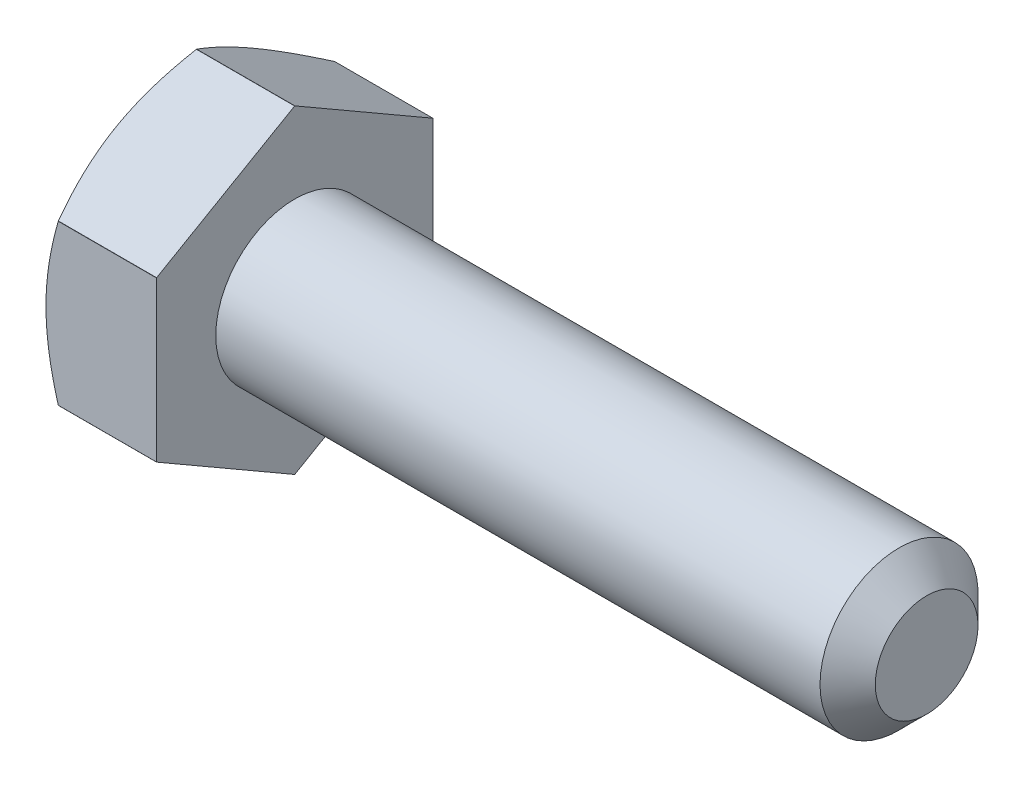
ISO-10303-21;
HEADER;
FILE_DESCRIPTION(('STEP AP214'),'2;1');
FILE_NAME('part.step','',(''),(''),'','','');
FILE_SCHEMA(('AUTOMOTIVE_DESIGN { 1 0 10303 214 1 1 1 1 }'));
ENDSEC;
DATA;
#1=APPLICATION_CONTEXT('core data for automotive mechanical design processes');
#2=APPLICATION_PROTOCOL_DEFINITION('international standard','automotive_design',2000,#1);
#3=PRODUCT_CONTEXT('',#1,'mechanical');
#4=PRODUCT('Part','Part','',(#3));
#5=PRODUCT_RELATED_PRODUCT_CATEGORY('part','',(#4));
#6=PRODUCT_DEFINITION_FORMATION('','',#4);
#7=PRODUCT_DEFINITION_CONTEXT('part definition',#1,'design');
#8=PRODUCT_DEFINITION('design','',#6,#7);
#9=PRODUCT_DEFINITION_SHAPE('','',#8);
#10=(LENGTH_UNIT() NAMED_UNIT(*) SI_UNIT(.MILLI.,.METRE.));
#11=(NAMED_UNIT(*) PLANE_ANGLE_UNIT() SI_UNIT($,.RADIAN.));
#12=(NAMED_UNIT(*) SI_UNIT($,.STERADIAN.) SOLID_ANGLE_UNIT());
#13=UNCERTAINTY_MEASURE_WITH_UNIT(LENGTH_MEASURE(1.E-05),#10,'distance_accuracy_value','');
#14=(GEOMETRIC_REPRESENTATION_CONTEXT(3) GLOBAL_UNCERTAINTY_ASSIGNED_CONTEXT((#13)) GLOBAL_UNIT_ASSIGNED_CONTEXT((#10,
#11,#12)) REPRESENTATION_CONTEXT('',''));
#15=CARTESIAN_POINT('',(0.,0.,0.));
#16=DIRECTION('',(0.,0.,1.));
#17=DIRECTION('',(1.,0.,0.));
#18=AXIS2_PLACEMENT_3D('',#15,#16,#17);
#19=CARTESIAN_POINT('',(-21.7002762428699,-3.88578058618805E-13,5.96744875736022E-13));
#20=DIRECTION('',(-0.999999999999988,0.,0.));
#21=DIRECTION('',(0.,0.,1.00000000000001));
#22=AXIS2_PLACEMENT_3D('',#19,#20,#21);
#23=CYLINDRICAL_SURFACE('',#22,4.04);
#24=CARTESIAN_POINT('',(-12.4867781868035,5.27355936696949E-13,3.7470027081099E-13));
#25=DIRECTION('',(0.999999999999988,0.,0.));
#26=DIRECTION('',(0.,0.,-1.00000000000001));
#27=AXIS2_PLACEMENT_3D('',#24,#25,#26);
#28=CIRCLE('',#27,4.04);
#29=CARTESIAN_POINT('',(-12.4867781868034,4.03999921649373,0.00251609449490597));
#30=VERTEX_POINT('',#29);
#31=CARTESIAN_POINT('',(-12.4867781868034,4.03999921649337,-0.00251609449405943));
#32=VERTEX_POINT('',#31);
#33=EDGE_CURVE('E143',#30,#32,#28,.F.);
#34=ORIENTED_EDGE('',*,*,#33,.F.);
#35=DIRECTION('',(-0.999999999999988,0.,0.));
#36=VECTOR('',#35,1.);
#37=CARTESIAN_POINT('',(-21.7002762428698,4.03999921649281,0.00251609449480883));
#38=LINE('',#37,#36);
#39=CARTESIAN_POINT('',(-9.99999999999952,4.03999999999971,0.00251473742225727));
#40=VERTEX_POINT('',#39);
#41=EDGE_CURVE('E152',#30,#40,#38,.F.);
#42=ORIENTED_EDGE('',*,*,#41,.T.);
#43=CARTESIAN_POINT('',(-9.99999999999973,-1.38777878078145E-13,2.4980018054066E-13));
#44=DIRECTION('',(-0.999999999999988,0.,0.));
#45=DIRECTION('',(0.,0.,1.00000000000001));
#46=AXIS2_PLACEMENT_3D('',#43,#44,#45);
#47=CIRCLE('',#46,4.04);
#48=CARTESIAN_POINT('',(-9.99999999999953,4.03999921649365,-0.00251609449423984));
#49=VERTEX_POINT('',#48);
#50=EDGE_CURVE('E185',#40,#49,#47,.T.);
#51=ORIENTED_EDGE('',*,*,#50,.T.);
#52=DIRECTION('',(-0.999999999999988,0.,0.));
#53=VECTOR('',#52,1.);
#54=CARTESIAN_POINT('',(-21.7002762428698,4.03999921649303,-0.0025160944940178));
#55=LINE('',#54,#53);
#56=EDGE_CURVE('E155',#49,#32,#55,.T.);
#57=ORIENTED_EDGE('',*,*,#56,.T.);
#58=EDGE_LOOP('',(#34,#42,#51,#57));
#59=FACE_BOUND('',#58,.T.);
#60=ADVANCED_FACE('F48',(#59),#23,.T.);
#61=CARTESIAN_POINT('',(-12.4867781868035,5.27355936696949E-13,3.7470027081099E-13));
#62=DIRECTION('',(0.999999999999988,0.,0.));
#63=DIRECTION('',(0.,0.,-1.00000000000001));
#64=AXIS2_PLACEMENT_3D('',#61,#62,#63);
#65=CIRCLE('',#64,4.04);
#66=CARTESIAN_POINT('',(-12.4867781868037,2.01782060649589,3.49999999999986));
#67=VERTEX_POINT('',#66);
#68=CARTESIAN_POINT('',(-12.4867781868037,2.02217860999732,3.49748390550578));
#69=VERTEX_POINT('',#68);
#70=EDGE_CURVE('E68',#67,#69,#65,.F.);
#71=ORIENTED_EDGE('',*,*,#70,.F.);
#72=DIRECTION('',(-0.999999999999988,0.,0.));
#73=VECTOR('',#72,1.);
#74=CARTESIAN_POINT('',(-21.7002762428699,2.01782060649552,3.49999999999959));
#75=LINE('',#74,#73);
#76=CARTESIAN_POINT('',(-9.99999999999987,2.01782060649558,3.49999999999945));
#77=VERTEX_POINT('',#76);
#78=EDGE_CURVE('E166',#67,#77,#75,.F.);
#79=ORIENTED_EDGE('',*,*,#78,.T.);
#80=CARTESIAN_POINT('',(-9.99999999999992,2.02217860999782,3.49748390550526));
#81=VERTEX_POINT('',#80);
#82=EDGE_CURVE('E181',#77,#81,#47,.T.);
#83=ORIENTED_EDGE('',*,*,#82,.T.);
#84=DIRECTION('',(-0.999999999999988,0.,0.));
#85=VECTOR('',#84,1.);
#86=CARTESIAN_POINT('',(-21.70027624287,2.02217860999718,3.49748390550535));
#87=LINE('',#86,#85);
#88=EDGE_CURVE('E162',#81,#69,#87,.T.);
#89=ORIENTED_EDGE('',*,*,#88,.T.);
#90=EDGE_LOOP('',(#71,#79,#83,#89));
#91=FACE_BOUND('',#90,.T.);
#92=ADVANCED_FACE('F211',(#91),#23,.T.);
#93=CARTESIAN_POINT('',(-12.4867781868035,5.27355936696949E-13,3.7470027081099E-13));
#94=DIRECTION('',(0.999999999999988,0.,0.));
#95=DIRECTION('',(0.,0.,-1.00000000000001));
#96=AXIS2_PLACEMENT_3D('',#93,#94,#95);
#97=CIRCLE('',#96,4.04);
#98=CARTESIAN_POINT('',(-12.4867781868035,-2.02217860999754,3.49748390550489));
#99=VERTEX_POINT('',#98);
#100=CARTESIAN_POINT('',(-12.4867781868038,-2.01782060649652,3.50000000000014));
#101=VERTEX_POINT('',#100);
#102=EDGE_CURVE('E241',#99,#101,#97,.F.);
#103=ORIENTED_EDGE('',*,*,#102,.F.);
#104=DIRECTION('',(-0.999999999999988,0.,0.));
#105=VECTOR('',#104,1.);
#106=CARTESIAN_POINT('',(-21.7002762428698,-2.02217860999765,3.49748390550501));
#107=LINE('',#106,#105);
#108=CARTESIAN_POINT('',(-9.99999999999969,-2.02217860999748,3.49748390550485));
#109=VERTEX_POINT('',#108);
#110=EDGE_CURVE('E261',#99,#109,#107,.F.);
#111=ORIENTED_EDGE('',*,*,#110,.T.);
#112=CARTESIAN_POINT('',(-9.99999999999972,-2.017820606496,3.50000000000017));
#113=VERTEX_POINT('',#112);
#114=EDGE_CURVE('E180',#109,#113,#47,.T.);
#115=ORIENTED_EDGE('',*,*,#114,.T.);
#116=DIRECTION('',(-0.999999999999988,0.,0.));
#117=VECTOR('',#116,1.);
#118=CARTESIAN_POINT('',(-21.7002762428698,-2.01782060649663,3.50000000000018));
#119=LINE('',#118,#117);
#120=EDGE_CURVE('E263',#113,#101,#119,.T.);
#121=ORIENTED_EDGE('',*,*,#120,.T.);
#122=EDGE_LOOP('',(#103,#111,#115,#121));
#123=FACE_BOUND('',#122,.T.);
#124=ADVANCED_FACE('F216',(#123),#23,.T.);
#125=CARTESIAN_POINT('',(-12.4867781868035,5.27355936696949E-13,3.7470027081099E-13));
#126=DIRECTION('',(0.999999999999988,0.,0.));
#127=DIRECTION('',(0.,0.,-1.00000000000001));
#128=AXIS2_PLACEMENT_3D('',#125,#126,#127);
#129=CIRCLE('',#128,4.04);
#130=CARTESIAN_POINT('',(-12.4867781868036,-4.0399992164929,-0.00251609449478107));
#131=VERTEX_POINT('',#130);
#132=CARTESIAN_POINT('',(-12.4867781868036,-4.03999921649376,0.00251609449468393));
#133=VERTEX_POINT('',#132);
#134=EDGE_CURVE('E291',#131,#133,#129,.F.);
#135=ORIENTED_EDGE('',*,*,#134,.F.);
#136=DIRECTION('',(-0.999999999999988,0.,0.));
#137=VECTOR('',#136,1.);
#138=CARTESIAN_POINT('',(-21.70027624287,-4.03999921649417,-0.0025160944943925));
#139=LINE('',#138,#137);
#140=CARTESIAN_POINT('',(-9.99999999999984,-4.04000000000002,-0.00251473742177155));
#141=VERTEX_POINT('',#140);
#142=EDGE_CURVE('E256',#131,#141,#139,.F.);
#143=ORIENTED_EDGE('',*,*,#142,.T.);
#144=CARTESIAN_POINT('',(-9.99999999999981,-4.03999921649373,0.00251609449485046));
#145=VERTEX_POINT('',#144);
#146=EDGE_CURVE('E273',#141,#145,#47,.T.);
#147=ORIENTED_EDGE('',*,*,#146,.T.);
#148=DIRECTION('',(-0.999999999999988,0.,0.));
#149=VECTOR('',#148,1.);
#150=CARTESIAN_POINT('',(-21.70027624287,-4.03999921649398,0.00251609449480883));
#151=LINE('',#150,#149);
#152=EDGE_CURVE('E258',#145,#133,#151,.T.);
#153=ORIENTED_EDGE('',*,*,#152,.T.);
#154=EDGE_LOOP('',(#135,#143,#147,#153));
#155=FACE_BOUND('',#154,.T.);
#156=ADVANCED_FACE('F229',(#155),#23,.T.);
#157=CARTESIAN_POINT('',(-12.4867781868035,5.27355936696949E-13,3.7470027081099E-13));
#158=DIRECTION('',(0.999999999999988,0.,0.));
#159=DIRECTION('',(0.,0.,-1.00000000000001));
#160=AXIS2_PLACEMENT_3D('',#157,#158,#159);
#161=CIRCLE('',#160,4.04);
#162=CARTESIAN_POINT('',(-12.4867781868037,-2.01782060649666,-3.50000000000021));
#163=VERTEX_POINT('',#162);
#164=CARTESIAN_POINT('',(-12.4867781868034,-2.02217860999743,-3.49748390550557));
#165=VERTEX_POINT('',#164);
#166=EDGE_CURVE('E288',#163,#165,#161,.F.);
#167=ORIENTED_EDGE('',*,*,#166,.F.);
#168=DIRECTION('',(-0.999999999999988,0.,0.));
#169=VECTOR('',#168,1.);
#170=CARTESIAN_POINT('',(-21.7002762428699,-2.01782060649713,-3.50000000000025));
#171=LINE('',#170,#169);
#172=CARTESIAN_POINT('',(-9.99999999999963,-2.0178206064963,-3.50000000000021));
#173=VERTEX_POINT('',#172);
#174=EDGE_CURVE('E246',#163,#173,#171,.F.);
#175=ORIENTED_EDGE('',*,*,#174,.T.);
#176=CARTESIAN_POINT('',(-9.99999999999967,-2.02217860999798,-3.49748390550565));
#177=VERTEX_POINT('',#176);
#178=EDGE_CURVE('E275',#173,#177,#47,.T.);
#179=ORIENTED_EDGE('',*,*,#178,.T.);
#180=DIRECTION('',(-0.999999999999988,0.,0.));
#181=VECTOR('',#180,1.);
#182=CARTESIAN_POINT('',(-21.7002762428699,-2.02217860999801,-3.49748390550551));
#183=LINE('',#182,#181);
#184=EDGE_CURVE('E253',#177,#165,#183,.T.);
#185=ORIENTED_EDGE('',*,*,#184,.T.);
#186=EDGE_LOOP('',(#167,#175,#179,#185));
#187=FACE_BOUND('',#186,.T.);
#188=ADVANCED_FACE('F220',(#187),#23,.T.);
#189=CARTESIAN_POINT('',(-12.4867781868035,5.27355936696949E-13,3.7470027081099E-13));
#190=DIRECTION('',(0.999999999999988,0.,0.));
#191=DIRECTION('',(0.,0.,-1.00000000000001));
#192=AXIS2_PLACEMENT_3D('',#189,#190,#191);
#193=CIRCLE('',#192,4.04);
#194=CARTESIAN_POINT('',(-12.4867781868035,2.02217860999748,-3.49748390550554));
#195=VERTEX_POINT('',#194);
#196=CARTESIAN_POINT('',(-12.4867781868035,2.01782060649589,-3.50000000000016));
#197=VERTEX_POINT('',#196);
#198=EDGE_CURVE('E233',#195,#197,#193,.F.);
#199=ORIENTED_EDGE('',*,*,#198,.F.);
#200=DIRECTION('',(-0.999999999999988,0.,0.));
#201=VECTOR('',#200,1.);
#202=CARTESIAN_POINT('',(-21.70027624287,2.02217860999709,-3.49748390550546));
#203=LINE('',#202,#201);
#204=CARTESIAN_POINT('',(-9.99999999999973,2.02217860999732,-3.49748390550589));
#205=VERTEX_POINT('',#204);
#206=EDGE_CURVE('E236',#195,#205,#203,.F.);
#207=ORIENTED_EDGE('',*,*,#206,.T.);
#208=CARTESIAN_POINT('',(-9.99999999999974,2.01782060649608,-3.50000000000016));
#209=VERTEX_POINT('',#208);
#210=EDGE_CURVE('E280',#205,#209,#47,.T.);
#211=ORIENTED_EDGE('',*,*,#210,.T.);
#212=DIRECTION('',(-0.999999999999988,0.,0.));
#213=VECTOR('',#212,1.);
#214=CARTESIAN_POINT('',(-21.70027624287,2.01782060649558,-3.50000000000014));
#215=LINE('',#214,#213);
#216=EDGE_CURVE('E239',#209,#197,#215,.T.);
#217=ORIENTED_EDGE('',*,*,#216,.T.);
#218=EDGE_LOOP('',(#199,#207,#211,#217));
#219=FACE_BOUND('',#218,.T.);
#220=ADVANCED_FACE('F212',(#219),#23,.T.);
#221=CARTESIAN_POINT('',(6.00099999999994,4.04145188432792,5.13478148889135E-13));
#222=DIRECTION('',(0.,0.866025403784457,-0.500000000000003));
#223=DIRECTION('',(0.,0.500000000000011,0.866025403784446));
#224=AXIS2_PLACEMENT_3D('',#221,#222,#223);
#225=PLANE('',#224);
#226=ORIENTED_EDGE('',*,*,#206,.F.);
#227=CARTESIAN_POINT('',(-12.4867115892039,2.02206313994374,-3.49768390550552));
#228=CARTESIAN_POINT('',(-12.5379309689224,2.11083925418278,-3.34391916514507));
#229=CARTESIAN_POINT('',(-12.5845026280281,2.20038173116099,-3.18882704558328));
#230=CARTESIAN_POINT('',(-12.6657698343882,2.3810152118615,-2.87596067946202));
#231=CARTESIAN_POINT('',(-12.7004366740023,2.47210941042985,-2.71818089926685));
#232=CARTESIAN_POINT('',(-12.754367701617,2.65316959786583,-2.40457545539977));
#233=CARTESIAN_POINT('',(-12.7739913877099,2.74310782795894,-2.24879787133568));
#234=CARTESIAN_POINT('',(-12.7973610333755,2.92340460361059,-1.9365146954662));
#235=CARTESIAN_POINT('',(-12.8011264053947,3.01376249965585,-1.78001022865079));
#236=CARTESIAN_POINT('',(-12.7930299124885,3.18241032610223,-1.4879036246596));
#237=CARTESIAN_POINT('',(-12.7831559178768,3.26072629875756,-1.35225638097637));
#238=CARTESIAN_POINT('',(-12.7519427748829,3.41684834222085,-1.08184506951645));
#239=CARTESIAN_POINT('',(-12.7305931001355,3.4946538783876,-0.947081927765486));
#240=CARTESIAN_POINT('',(-12.6772526840214,3.65109435005896,-0.676119082470696));
#241=CARTESIAN_POINT('',(-12.6450372225947,3.72970961970034,-0.539953441201146));
#242=CARTESIAN_POINT('',(-12.5719331356329,3.88577179011204,-0.269645832908455));
#243=CARTESIAN_POINT('',(-12.5310615391959,3.96322066967242,-0.135500438520382));
#244=CARTESIAN_POINT('',(-12.4867111372952,4.04011547005381,-0.00231473742141886));
#245=B_SPLINE_CURVE_WITH_KNOTS('',3,(#227,#228,#229,#230,#231,#232,#233,#234,#235,#236,#237,
#238,#239,#240,#241,#242,#243,#244),.UNSPECIFIED.,.F.,.F.,(4,2,2,2,2,2,2,2,4),(0.,
0.554594996401788,1.11051812021847,1.65270171994499,2.19422142975073,2.66460527350106,
3.13542132719048,3.61664143895133,4.09692350354231),.UNSPECIFIED.);
#246=EDGE_CURVE('E242',#195,#32,#245,.T.);
#247=ORIENTED_EDGE('',*,*,#246,.T.);
#248=ORIENTED_EDGE('',*,*,#56,.F.);
#249=DIRECTION('',(0.,0.500000000000011,0.866025403784446));
#250=VECTOR('',#249,1.);
#251=CARTESIAN_POINT('',(-9.99999999999952,4.04145188432728,-3.88578058618805E-13));
#252=LINE('',#251,#250);
#253=EDGE_CURVE('E175',#205,#49,#252,.T.);
#254=ORIENTED_EDGE('',*,*,#253,.F.);
#255=EDGE_LOOP('',(#226,#247,#248,#254));
#256=FACE_BOUND('',#255,.T.);
#257=ADVANCED_FACE('F219',(#256),#225,.T.);
#258=CARTESIAN_POINT('',(6.00100000000008,2.02072594216371,-3.5000000000001));
#259=DIRECTION('',(0.,0.,-1.00000000000001));
#260=DIRECTION('',(0.,1.00000000000002,0.));
#261=AXIS2_PLACEMENT_3D('',#258,#259,#260);
#262=PLANE('',#261);
#263=ORIENTED_EDGE('',*,*,#174,.F.);
#264=CARTESIAN_POINT('',(-11.0878625035084,-5.4332567601573,-3.50000000000032));
#265=CARTESIAN_POINT('',(-11.162071173753,-5.28032168569229,-3.50000000000017));
#266=CARTESIAN_POINT('',(-11.2355697549627,-5.1270360631059,-3.50000000000011));
#267=CARTESIAN_POINT('',(-11.3807474004665,-4.81957728000819,-3.50000000000007));
#268=CARTESIAN_POINT('',(-11.4524261788485,-4.66540398464429,-3.50000000000009));
#269=CARTESIAN_POINT('',(-11.5939242264986,-4.3551918928741,-3.5000000000001));
#270=CARTESIAN_POINT('',(-11.663731298243,-4.19914751353121,-3.50000000000009));
#271=CARTESIAN_POINT('',(-11.800495118136,-3.88581923270795,-3.50000000000009));
#272=CARTESIAN_POINT('',(-11.8674520007226,-3.72853539010643,-3.50000000000009));
#273=CARTESIAN_POINT('',(-11.9998455746438,-3.40742685258886,-3.50000000000009));
#274=CARTESIAN_POINT('',(-12.0651653909569,-3.24355370604809,-3.50000000000009));
#275=CARTESIAN_POINT('',(-12.1908742688605,-2.91389229266728,-3.50000000000009));
#276=CARTESIAN_POINT('',(-12.2512627780486,-2.74810381364065,-3.50000000000009));
#277=CARTESIAN_POINT('',(-12.3655280115626,-2.41465637682771,-3.5000000000001));
#278=CARTESIAN_POINT('',(-12.4194178595039,-2.24700196174926,-3.5000000000001));
#279=CARTESIAN_POINT('',(-12.5189602544059,-1.90928844620099,-3.50000000000009));
#280=CARTESIAN_POINT('',(-12.5646153890773,-1.73923011932486,-3.50000000000009));
#281=CARTESIAN_POINT('',(-12.6452638149893,-1.3975332455929,-3.50000000000008));
#282=CARTESIAN_POINT('',(-12.6803136739309,-1.22590830023671,-3.50000000000009));
#283=CARTESIAN_POINT('',(-12.7377654642155,-0.880518891135827,-3.5000000000001));
#284=CARTESIAN_POINT('',(-12.7601686430386,-0.706754640142577,-3.50000000000012));
#285=CARTESIAN_POINT('',(-12.7902469194188,-0.36022752681562,-3.50000000000007));
#286=CARTESIAN_POINT('',(-12.7981118853854,-0.18748156117592,-3.50000000000001));
#287=CARTESIAN_POINT('',(-12.7989470859915,0.158061993886431,-3.50000000000019));
#288=CARTESIAN_POINT('',(-12.7919169361069,0.330859584526662,-3.50000000000043));
#289=CARTESIAN_POINT('',(-12.7678518946359,0.624018548334433,-3.50000000000034));
#290=CARTESIAN_POINT('',(-12.754413605359,0.744693201117906,-3.50000000000016));
#291=CARTESIAN_POINT('',(-12.7211058318827,0.985157714111311,-3.50000000000003));
#292=CARTESIAN_POINT('',(-12.701235480555,1.10494745279456,-3.50000000000007));
#293=CARTESIAN_POINT('',(-12.6330209120466,1.46282737494516,-3.50000000000014));
#294=CARTESIAN_POINT('',(-12.5760852790442,1.6992981391599,-3.50000000000011));
#295=CARTESIAN_POINT('',(-12.4773566749926,2.05297435976177,-3.50000000000009));
#296=CARTESIAN_POINT('',(-12.4417530403685,2.17201178653606,-3.5000000000001));
#297=CARTESIAN_POINT('',(-12.3668512807451,2.40892979401905,-3.5000000000001));
#298=CARTESIAN_POINT('',(-12.3275531293773,2.5268103664644,-3.5000000000001));
#299=CARTESIAN_POINT('',(-12.2458928559646,2.76145316567827,-3.5000000000001));
#300=CARTESIAN_POINT('',(-12.203531721972,2.87821573944726,-3.50000000000011));
#301=CARTESIAN_POINT('',(-12.1162436413933,3.11077255287424,-3.50000000000009));
#302=CARTESIAN_POINT('',(-12.0713167395903,3.22656680939285,-3.50000000000005));
#303=CARTESIAN_POINT('',(-11.9537424943461,3.52146255197488,-3.50000000000003));
#304=CARTESIAN_POINT('',(-11.8795744165549,3.69995694657335,-3.50000000000008));
#305=CARTESIAN_POINT('',(-11.7272944642699,4.05526106859074,-3.50000000000012));
#306=CARTESIAN_POINT('',(-11.6491822550533,4.23207065150763,-3.5000000000001));
#307=CARTESIAN_POINT('',(-11.4898923140522,4.58435765259035,-3.5000000000001));
#308=CARTESIAN_POINT('',(-11.4087137497204,4.75983469319768,-3.5000000000001));
#309=CARTESIAN_POINT('',(-11.2439656712409,5.10966471537732,-3.5000000000001));
#310=CARTESIAN_POINT('',(-11.1603960953771,5.28401766779244,-3.5000000000001));
#311=CARTESIAN_POINT('',(-10.9066472841791,5.80616172193644,-3.5000000000001));
#312=CARTESIAN_POINT('',(-10.7336398208236,6.15257698104781,-3.5000000000001));
#313=CARTESIAN_POINT('',(-10.382759229295,6.84284506031148,-3.5000000000001));
#314=CARTESIAN_POINT('',(-10.2048869010935,7.18669829006785,-3.5000000000001));
#315=CARTESIAN_POINT('',(-9.86299244373221,7.83971892239608,-3.5000000000001));
#316=CARTESIAN_POINT('',(-9.69927923178288,8.14904834744595,-3.50000000000011));
#317=CARTESIAN_POINT('',(-9.36980939724,8.76663438023214,-3.5000000000001));
#318=CARTESIAN_POINT('',(-9.20405267664364,9.0748909355994,-3.5000000000001));
#319=CARTESIAN_POINT('',(-8.87149049342556,9.68968050298727,-3.50000000000011));
#320=CARTESIAN_POINT('',(-8.70468947256805,9.99621592063807,-3.50000000000013));
#321=CARTESIAN_POINT('',(-8.36990136293495,10.6086123854295,-3.50000000000008));
#322=CARTESIAN_POINT('',(-8.20191435313071,10.9144734757245,-3.5));
#323=CARTESIAN_POINT('',(-8.03349193096401,11.2200929283097,-3.49999999999982));
#324=B_SPLINE_CURVE_WITH_KNOTS('',3,(#264,#265,#266,#267,#268,#269,#270,#271,#272,#273,#274,
#275,#276,#277,#278,#279,#280,#281,#282,#283,#284,#285,#286,#287,#288,#289,#290,#291,#292,#293,
#294,#295,#296,#297,#298,#299,#300,#301,#302,#303,#304,#305,#306,#307,#308,#309,#310,#311,#312,
#313,#314,#315,#316,#317,#318,#319,#320,#321,#322,#323),.UNSPECIFIED.,.F.,.F.,(4,2,2,2,2,2,2,2,
2,2,2,2,2,2,2,2,2,2,2,2,2,2,2,2,2,2,2,2,2,4),(0.,0.509971477050415,1.02002258680602,
1.53284075002488,2.04563469769518,2.57480844614891,3.10404139127904,3.63218702296393,
4.16016639770017,4.68527780424614,5.21033740426859,5.72848993955095,6.24665585133184,
6.61074120458304,6.97487566188386,7.70353485842514,8.0762467628583,8.44896132761608,
8.82155619449794,9.1941445600827,9.77394747187977,10.353799672229,10.9338104563481,
11.5138362250527,12.6754095408282,13.836792984062,14.886725680852,15.9367089278384,
16.9836438821615,18.0305097697318),.UNSPECIFIED.);
#325=EDGE_CURVE('E286',#163,#197,#324,.T.);
#326=ORIENTED_EDGE('',*,*,#325,.T.);
#327=ORIENTED_EDGE('',*,*,#216,.F.);
#328=DIRECTION('',(0.,1.00000000000002,0.));
#329=VECTOR('',#328,1.);
#330=CARTESIAN_POINT('',(-9.99999999999969,2.02072594216338,-3.49999999999996));
#331=LINE('',#330,#329);
#332=EDGE_CURVE('E161',#173,#209,#331,.T.);
#333=ORIENTED_EDGE('',*,*,#332,.F.);
#334=EDGE_LOOP('',(#263,#326,#327,#333));
#335=FACE_BOUND('',#334,.T.);
#336=ADVANCED_FACE('F226',(#335),#262,.T.);
#337=CARTESIAN_POINT('',(6.00099999999987,-2.02072594216327,-3.49999999999977));
#338=DIRECTION('',(0.,-0.866025403784458,-0.500000000000003));
#339=DIRECTION('',(0.,0.50000000000001,-0.866025403784442));
#340=AXIS2_PLACEMENT_3D('',#337,#338,#339);
#341=PLANE('',#340);
#342=ORIENTED_EDGE('',*,*,#142,.F.);
#343=CARTESIAN_POINT('',(-12.4867111372954,-4.04011547005428,-0.00231473742171029));
#344=CARTESIAN_POINT('',(-12.5379305538839,-3.95133934311711,-0.156079499774761));
#345=CARTESIAN_POINT('',(-12.5845022522201,-3.86179685336128,-0.31117164146768));
#346=CARTESIAN_POINT('',(-12.6657695401391,-3.68116334587561,-0.624038053982074));
#347=CARTESIAN_POINT('',(-12.700436422039,-3.59006913329222,-0.781817858452208));
#348=CARTESIAN_POINT('',(-12.7543675338004,-3.40900891729688,-1.09542335178527));
#349=CARTESIAN_POINT('',(-12.7739912618312,-3.31907067270385,-1.25120096096351));
#350=CARTESIAN_POINT('',(-12.797360988344,-3.13877386633921,-1.56348419003063));
#351=CARTESIAN_POINT('',(-12.8011263992984,-3.04841595408389,-1.71998868492431));
#352=CARTESIAN_POINT('',(-12.7930299741013,-2.87976812699181,-2.01209529003364));
#353=CARTESIAN_POINT('',(-12.7831560139691,-2.80145217002725,-2.14774250653822));
#354=CARTESIAN_POINT('',(-12.7519429416812,-2.64533015669105,-2.41815376581543));
#355=CARTESIAN_POINT('',(-12.7305933031675,-2.56752463495915,-2.55291688256489));
#356=CARTESIAN_POINT('',(-12.6772529598613,-2.41108419186391,-2.82387967836468));
#357=CARTESIAN_POINT('',(-12.6450375350459,-2.33246893633752,-2.96004529518624));
#358=CARTESIAN_POINT('',(-12.571933519469,-2.17640679335349,-3.23035285597273));
#359=CARTESIAN_POINT('',(-12.5310619577912,-2.09895792710904,-3.36449822729697));
#360=CARTESIAN_POINT('',(-12.4867115892038,-2.0220631399438,-3.49768390550528));
#361=B_SPLINE_CURVE_WITH_KNOTS('',3,(#343,#344,#345,#346,#347,#348,#349,#350,#351,#352,#353,
#354,#355,#356,#357,#358,#359,#360),.UNSPECIFIED.,.F.,.F.,(4,2,2,2,2,2,2,2,4),(0.,
0.554595100417686,1.1105183307832,1.65270203067846,2.19422183977631,2.66460558322844,
3.13542153630084,3.61664154292043,4.09692350354318),.UNSPECIFIED.);
#362=EDGE_CURVE('E248',#131,#165,#361,.T.);
#363=ORIENTED_EDGE('',*,*,#362,.T.);
#364=ORIENTED_EDGE('',*,*,#184,.F.);
#365=DIRECTION('',(0.,0.50000000000001,-0.866025403784442));
#366=VECTOR('',#365,1.);
#367=CARTESIAN_POINT('',(-9.9999999999996,-2.02072594216415,-3.50000000000032));
#368=LINE('',#367,#366);
#369=EDGE_CURVE('E164',#141,#177,#368,.T.);
#370=ORIENTED_EDGE('',*,*,#369,.F.);
#371=EDGE_LOOP('',(#342,#363,#364,#370));
#372=FACE_BOUND('',#371,.T.);
#373=ADVANCED_FACE('F378',(#372),#341,.T.);
#374=CARTESIAN_POINT('',(6.00099999999994,-4.041451884327,0.));
#375=DIRECTION('',(0.,-0.866025403784456,0.500000000000003));
#376=DIRECTION('',(0.,-0.500000000000012,-0.866025403784444));
#377=AXIS2_PLACEMENT_3D('',#374,#375,#376);
#378=PLANE('',#377);
#379=ORIENTED_EDGE('',*,*,#110,.F.);
#380=CARTESIAN_POINT('',(-12.4867115892038,-2.0220631399441,3.49768390550534));
#381=CARTESIAN_POINT('',(-12.5379309689224,-2.11083925418265,3.34391916514468));
#382=CARTESIAN_POINT('',(-12.5845026280282,-2.20038173116065,3.18882704558282));
#383=CARTESIAN_POINT('',(-12.6657698343882,-2.381015211861,2.87596067946153));
#384=CARTESIAN_POINT('',(-12.7004366740022,-2.4721094104294,2.7181808992664));
#385=CARTESIAN_POINT('',(-12.7543677016168,-2.65316959786539,2.40457545539936));
#386=CARTESIAN_POINT('',(-12.7739913877097,-2.74310782795848,2.24879787133528));
#387=CARTESIAN_POINT('',(-12.7973610333753,-2.9234046036101,1.93651469546584));
#388=CARTESIAN_POINT('',(-12.8011264053947,-3.01376249965537,1.78001022865048));
#389=CARTESIAN_POINT('',(-12.7930299124884,-3.18241032610173,1.48790362465931));
#390=CARTESIAN_POINT('',(-12.7831559178765,-3.26072629875705,1.35225638097606));
#391=CARTESIAN_POINT('',(-12.7519427748824,-3.41684834222035,1.08184506951611));
#392=CARTESIAN_POINT('',(-12.730593100135,-3.49465387838714,0.947081927765123));
#393=CARTESIAN_POINT('',(-12.6772526840209,-3.65109435005849,0.676119082470284));
#394=CARTESIAN_POINT('',(-12.645037222594,-3.72970961969983,0.539953441200703));
#395=CARTESIAN_POINT('',(-12.5719331356324,-3.88577179011168,0.269645832908009));
#396=CARTESIAN_POINT('',(-12.5310615391956,-3.96322066967224,0.135500438519964));
#397=CARTESIAN_POINT('',(-12.4867111372954,-4.04011547005409,0.00231473742107191));
#398=B_SPLINE_CURVE_WITH_KNOTS('',3,(#380,#381,#382,#383,#384,#385,#386,#387,#388,#389,#390,
#391,#392,#393,#394,#395,#396,#397),.UNSPECIFIED.,.F.,.F.,(4,2,2,2,2,2,2,2,4),(0.,
0.554594996401662,1.11051812021828,1.65270171994473,2.19422142975038,2.66460527350077,
3.13542132719027,3.61664143895121,4.09692350354222),.UNSPECIFIED.);
#399=EDGE_CURVE('E289',#99,#133,#398,.T.);
#400=ORIENTED_EDGE('',*,*,#399,.T.);
#401=ORIENTED_EDGE('',*,*,#152,.F.);
#402=DIRECTION('',(0.,-0.500000000000012,-0.866025403784444));
#403=VECTOR('',#402,1.);
#404=CARTESIAN_POINT('',(-9.99999999999982,-4.04145188432781,2.4980018054066E-13));
#405=LINE('',#404,#403);
#406=EDGE_CURVE('E171',#109,#145,#405,.T.);
#407=ORIENTED_EDGE('',*,*,#406,.F.);
#408=EDGE_LOOP('',(#379,#400,#401,#407));
#409=FACE_BOUND('',#408,.T.);
#410=ADVANCED_FACE('F380',(#409),#378,.T.);
#411=CARTESIAN_POINT('',(6.00100000000002,-2.02072594216368,3.49999999999985));
#412=DIRECTION('',(0.,0.,1.00000000000001));
#413=DIRECTION('',(0.,-1.00000000000002,0.));
#414=AXIS2_PLACEMENT_3D('',#411,#412,#413);
#415=PLANE('',#414);
#416=ORIENTED_EDGE('',*,*,#78,.F.);
#417=CARTESIAN_POINT('',(-11.0878625034226,-5.43325676033418,3.49999999999948));
#418=CARTESIAN_POINT('',(-11.1620711736709,-5.28032168586324,3.49999999999972));
#419=CARTESIAN_POINT('',(-11.2355697548842,-5.12703606327088,3.49999999999982));
#420=CARTESIAN_POINT('',(-11.3807474003952,-4.81957728016123,3.49999999999989));
#421=CARTESIAN_POINT('',(-11.4524261787808,-4.66540398479134,3.49999999999986));
#422=CARTESIAN_POINT('',(-11.593924226438,-4.35519189300911,3.49999999999984));
#423=CARTESIAN_POINT('',(-11.6637312981861,-4.19914751366015,3.49999999999985));
#424=CARTESIAN_POINT('',(-11.8004951180861,-3.88581923282472,3.49999999999986));
#425=CARTESIAN_POINT('',(-11.8674520006763,-3.72853539021709,3.49999999999985));
#426=CARTESIAN_POINT('',(-11.9998455746046,-3.40742685268686,3.49999999999985));
#427=CARTESIAN_POINT('',(-12.0651653909213,-3.24355370613952,3.49999999999985));
#428=CARTESIAN_POINT('',(-12.1908742688319,-2.91389229274547,3.49999999999985));
#429=CARTESIAN_POINT('',(-12.2512627780234,-2.74810381371217,3.49999999999985));
#430=CARTESIAN_POINT('',(-12.3655280115439,-2.41465637688576,3.49999999999986));
#431=CARTESIAN_POINT('',(-12.4194178594884,-2.24700196180052,3.49999999999987));
#432=CARTESIAN_POINT('',(-12.5189602543959,-1.90928844623842,3.49999999999983));
#433=CARTESIAN_POINT('',(-12.5646153890697,-1.73923011935524,3.49999999999978));
#434=CARTESIAN_POINT('',(-12.6452638149869,-1.39753324560572,3.49999999999978));
#435=CARTESIAN_POINT('',(-12.680313673931,-1.22590830023897,3.49999999999984));
#436=CARTESIAN_POINT('',(-12.7377654642189,-0.880518891116689,3.49999999999986));
#437=CARTESIAN_POINT('',(-12.7601686430427,-0.706754640112592,3.49999999999983));
#438=CARTESIAN_POINT('',(-12.7902469194225,-0.360227526764133,3.49999999999987));
#439=CARTESIAN_POINT('',(-12.7981118853881,-0.187481561113781,3.49999999999995));
#440=CARTESIAN_POINT('',(-12.7989470859899,0.158061993969699,3.49999999999975));
#441=CARTESIAN_POINT('',(-12.7919169361021,0.330859584620405,3.49999999999946));
#442=CARTESIAN_POINT('',(-12.7678518946252,0.624018548441464,3.49999999999956));
#443=CARTESIAN_POINT('',(-12.7544136053461,0.744693201227852,3.49999999999977));
#444=CARTESIAN_POINT('',(-12.721105831865,0.985157714226928,3.49999999999993));
#445=CARTESIAN_POINT('',(-12.7012354805348,1.10494745291294,3.49999999999988));
#446=CARTESIAN_POINT('',(-12.6330209120188,1.46282737507165,3.49999999999979));
#447=CARTESIAN_POINT('',(-12.5760852790113,1.69929813929159,3.49999999999984));
#448=CARTESIAN_POINT('',(-12.4773566749522,2.05297435990125,3.49999999999986));
#449=CARTESIAN_POINT('',(-12.4417530403255,2.17201178667819,3.49999999999985));
#450=CARTESIAN_POINT('',(-12.3668512806971,2.40892979416644,3.49999999999984));
#451=CARTESIAN_POINT('',(-12.3275531293269,2.52681036661441,3.49999999999983));
#452=CARTESIAN_POINT('',(-12.2458928559094,2.76145316583353,3.49999999999987));
#453=CARTESIAN_POINT('',(-12.2035317219145,2.87821573960516,3.49999999999991));
#454=CARTESIAN_POINT('',(-12.1162436413309,3.11077255303727,3.49999999999978));
#455=CARTESIAN_POINT('',(-12.0713167395253,3.22656680955838,3.4999999999996));
#456=CARTESIAN_POINT('',(-11.9537424942772,3.521462552142,3.49999999999949));
#457=CARTESIAN_POINT('',(-11.8795744164851,3.69995694673976,3.49999999999975));
#458=CARTESIAN_POINT('',(-11.7272944641982,4.05526106875561,3.49999999999994));
#459=CARTESIAN_POINT('',(-11.6491822549806,4.23207065167167,3.49999999999987));
#460=CARTESIAN_POINT('',(-11.4898923139777,4.58435765275288,3.49999999999982));
#461=CARTESIAN_POINT('',(-11.4087137496453,4.75983469335952,3.49999999999984));
#462=CARTESIAN_POINT('',(-11.2439656711647,5.10966471553784,3.49999999999985));
#463=CARTESIAN_POINT('',(-11.1603960953004,5.28401766795232,3.49999999999985));
#464=CARTESIAN_POINT('',(-10.906647284101,5.80616172209443,3.49999999999984));
#465=CARTESIAN_POINT('',(-10.733639820745,6.15257698120465,3.49999999999984));
#466=CARTESIAN_POINT('',(-10.3827592292156,6.84284506046615,3.49999999999985));
#467=CARTESIAN_POINT('',(-10.2048869010138,7.18669829022152,3.49999999999985));
#468=CARTESIAN_POINT('',(-9.86299244365186,7.83971892254871,3.49999999999984));
#469=CARTESIAN_POINT('',(-9.69927923170206,8.14904834759855,3.49999999999984));
#470=CARTESIAN_POINT('',(-9.36980939715833,8.76663438038469,3.49999999999984));
#471=CARTESIAN_POINT('',(-9.20405267656158,9.07489093575195,3.49999999999984));
#472=CARTESIAN_POINT('',(-8.87149049334274,9.68968050314001,3.49999999999984));
#473=CARTESIAN_POINT('',(-8.70468947248485,9.99621592079101,3.49999999999984));
#474=CARTESIAN_POINT('',(-8.36990136285097,10.6086123855828,3.49999999999984));
#475=CARTESIAN_POINT('',(-8.20191435304631,10.914473475878,3.49999999999985));
#476=CARTESIAN_POINT('',(-8.03349193087912,11.2200929284633,3.49999999999985));
#477=B_SPLINE_CURVE_WITH_KNOTS('',3,(#417,#418,#419,#420,#421,#422,#423,#424,#425,#426,#427,
#428,#429,#430,#431,#432,#433,#434,#435,#436,#437,#438,#439,#440,#441,#442,#443,#444,#445,#446,
#447,#448,#449,#450,#451,#452,#453,#454,#455,#456,#457,#458,#459,#460,#461,#462,#463,#464,#465,
#466,#467,#468,#469,#470,#471,#472,#473,#474,#475,#476),.UNSPECIFIED.,.F.,.F.,(4,2,2,2,2,2,2,2,
2,2,2,2,2,2,2,2,2,2,2,2,2,2,2,2,2,2,2,2,2,4),(0.,0.509971477071227,1.02002258684764,
1.5328407500875,2.04563469777879,2.57480844625483,3.10404139140725,3.6321870231144,
4.16016639787289,4.68527780445137,5.21033740450624,5.72848993982025,6.24665585163283,
6.61074120489346,6.97487566220367,7.70353485876374,8.0762467632067,8.44896132797427,
8.82155619486592,9.19414456046048,9.77394747225657,10.3537996726048,10.9338104567228,
11.5138362254265,12.6754095411996,13.836792984431,14.8867256812215,15.9367089282085,
16.9836438825326,18.030509770104),.UNSPECIFIED.);
#478=EDGE_CURVE('E156',#67,#101,#477,.F.);
#479=ORIENTED_EDGE('',*,*,#478,.T.);
#480=ORIENTED_EDGE('',*,*,#120,.F.);
#481=DIRECTION('',(0.,-1.00000000000002,0.));
#482=VECTOR('',#481,1.);
#483=CARTESIAN_POINT('',(-9.99999999999969,-2.02072594216399,3.49999999999998));
#484=LINE('',#483,#482);
#485=EDGE_CURVE('E75',#77,#113,#484,.T.);
#486=ORIENTED_EDGE('',*,*,#485,.F.);
#487=EDGE_LOOP('',(#416,#479,#480,#486));
#488=FACE_BOUND('',#487,.T.);
#489=ADVANCED_FACE('F208',(#488),#415,.T.);
#490=CARTESIAN_POINT('',(6.00099999999991,2.0207259421641,3.50000000000006));
#491=DIRECTION('',(0.,0.866025403784458,0.500000000000003));
#492=DIRECTION('',(0.,-0.50000000000001,0.866025403784442));
#493=AXIS2_PLACEMENT_3D('',#490,#491,#492);
#494=PLANE('',#493);
#495=ORIENTED_EDGE('',*,*,#41,.F.);
#496=CARTESIAN_POINT('',(-12.4867111372952,4.04011547005392,0.00231473742186294));
#497=CARTESIAN_POINT('',(-12.5379305538842,3.95133934311755,0.156079499775285));
#498=CARTESIAN_POINT('',(-12.5845022522206,3.86179685336192,0.311171641468303));
#499=CARTESIAN_POINT('',(-12.6657695401396,3.68116334587629,0.62403805398273));
#500=CARTESIAN_POINT('',(-12.7004364220394,3.59006913329276,0.781817858452797));
#501=CARTESIAN_POINT('',(-12.7543675338009,3.40900891729763,1.09542335178601));
#502=CARTESIAN_POINT('',(-12.7739912618318,3.31907067270495,1.25120096096446));
#503=CARTESIAN_POINT('',(-12.7973609883443,3.13877386633937,1.56348419003109));
#504=CARTESIAN_POINT('',(-12.8011263992983,3.04841595408276,1.71998868492406));
#505=CARTESIAN_POINT('',(-12.7930299741011,2.87976812699086,2.01209529003352));
#506=CARTESIAN_POINT('',(-12.7831560139693,2.80145217002744,2.14774250653872));
#507=CARTESIAN_POINT('',(-12.7519429416816,2.64533015669212,2.41815376581633));
#508=CARTESIAN_POINT('',(-12.7305933031678,2.56752463495993,2.55291688256557));
#509=CARTESIAN_POINT('',(-12.6772529598615,2.41108419186454,2.82387967836511));
#510=CARTESIAN_POINT('',(-12.6450375350461,2.33246893633828,2.96004529518667));
#511=CARTESIAN_POINT('',(-12.5719335194693,2.17640679335435,3.23035285597309));
#512=CARTESIAN_POINT('',(-12.5310619577915,2.09895792710986,3.36449822729726));
#513=CARTESIAN_POINT('',(-12.4867115892041,2.02206313994424,3.49768390550531));
#514=B_SPLINE_CURVE_WITH_KNOTS('',3,(#496,#497,#498,#499,#500,#501,#502,#503,#504,#505,#506,
#507,#508,#509,#510,#511,#512,#513),.UNSPECIFIED.,.F.,.F.,(4,2,2,2,2,2,2,2,4),(0.,
0.554595100417796,1.11051833078331,1.65270203067861,2.19422183977655,2.66460558322856,
3.13542153630079,3.61664154292019,4.09692350354281),.UNSPECIFIED.);
#515=EDGE_CURVE('E13',#30,#69,#514,.T.);
#516=ORIENTED_EDGE('',*,*,#515,.T.);
#517=ORIENTED_EDGE('',*,*,#88,.F.);
#518=DIRECTION('',(0.,-0.50000000000001,0.866025403784442));
#519=VECTOR('',#518,1.);
#520=CARTESIAN_POINT('',(-9.99999999999992,2.0207259421634,3.49999999999985));
#521=LINE('',#520,#519);
#522=EDGE_CURVE('E160',#40,#81,#521,.T.);
#523=ORIENTED_EDGE('',*,*,#522,.F.);
#524=EDGE_LOOP('',(#495,#516,#517,#523));
#525=FACE_BOUND('',#524,.T.);
#526=ADVANCED_FACE('F159',(#525),#494,.T.);
#527=CARTESIAN_POINT('',(-9.99999999999951,4.03999999999979,-8.04911692853238E-13));
#528=DIRECTION('',(-0.999999999999988,0.,0.));
#529=DIRECTION('',(0.,0.,1.00000000000001));
#530=AXIS2_PLACEMENT_3D('',#527,#528,#529);
#531=PLANE('',#530);
#532=ORIENTED_EDGE('',*,*,#522,.T.);
#533=ORIENTED_EDGE('',*,*,#82,.F.);
#534=ORIENTED_EDGE('',*,*,#485,.T.);
#535=ORIENTED_EDGE('',*,*,#114,.F.);
#536=ORIENTED_EDGE('',*,*,#406,.T.);
#537=ORIENTED_EDGE('',*,*,#146,.F.);
#538=ORIENTED_EDGE('',*,*,#369,.T.);
#539=ORIENTED_EDGE('',*,*,#178,.F.);
#540=ORIENTED_EDGE('',*,*,#332,.T.);
#541=ORIENTED_EDGE('',*,*,#210,.F.);
#542=ORIENTED_EDGE('',*,*,#253,.T.);
#543=ORIENTED_EDGE('',*,*,#50,.F.);
#544=EDGE_LOOP('',(#532,#533,#534,#535,#536,#537,#538,#539,#540,#541,#542,#543));
#545=FACE_BOUND('',#544,.T.);
#546=CARTESIAN_POINT('',(-9.99999999999975,-1.38777878078145E-13,2.4980018054066E-13));
#547=DIRECTION('',(-0.999999999999988,0.,0.));
#548=DIRECTION('',(0.,0.,1.00000000000001));
#549=AXIS2_PLACEMENT_3D('',#546,#547,#548);
#550=CIRCLE('',#549,2.);
#551=CARTESIAN_POINT('',(-9.99999999999975,-1.37112543541207E-13,2.00000000000026));
#552=VERTEX_POINT('',#551);
#553=EDGE_CURVE('E177',#552,#552,#550,.T.);
#554=ORIENTED_EDGE('',*,*,#553,.T.);
#555=EDGE_LOOP('',(#554));
#556=FACE_BOUND('',#555,.T.);
#557=ADVANCED_FACE('F199',(#545,#556),#531,.F.);
#558=CARTESIAN_POINT('',(-21.7002762428699,-3.88578058618805E-13,5.96744875736022E-13));
#559=DIRECTION('',(-0.999999999999988,0.,0.));
#560=DIRECTION('',(0.,0.,1.00000000000001));
#561=AXIS2_PLACEMENT_3D('',#558,#559,#560);
#562=CYLINDRICAL_SURFACE('',#561,2.);
#563=CARTESIAN_POINT('',(5.30000000000003,0.,0.));
#564=DIRECTION('',(-0.999999999999988,0.,0.));
#565=DIRECTION('',(0.,0.,1.00000000000001));
#566=AXIS2_PLACEMENT_3D('',#563,#564,#565);
#567=CIRCLE('',#566,2.);
#568=CARTESIAN_POINT('',(5.30000000000003,0.,1.99999999999997));
#569=VERTEX_POINT('',#568);
#570=EDGE_CURVE('E184',#569,#569,#567,.T.);
#571=ORIENTED_EDGE('',*,*,#570,.T.);
#572=EDGE_LOOP('',(#571));
#573=FACE_BOUND('',#572,.T.);
#574=ORIENTED_EDGE('',*,*,#553,.F.);
#575=EDGE_LOOP('',(#574));
#576=FACE_BOUND('',#575,.T.);
#577=ADVANCED_FACE('F196',(#573,#576),#562,.T.);
#578=CARTESIAN_POINT('',(5.99999999999995,2.00000000000036,0.));
#579=DIRECTION('',(-0.999999999999988,0.,0.));
#580=DIRECTION('',(0.,0.,1.00000000000001));
#581=AXIS2_PLACEMENT_3D('',#578,#579,#580);
#582=PLANE('',#581);
#583=CARTESIAN_POINT('',(6.00000000000006,4.71844785465692E-13,0.));
#584=DIRECTION('',(-0.999999999999988,0.,0.));
#585=DIRECTION('',(0.,0.,1.00000000000001));
#586=AXIS2_PLACEMENT_3D('',#583,#584,#585);
#587=CIRCLE('',#586,1.29999999999999);
#588=CARTESIAN_POINT('',(6.00000000000006,4.72927252914701E-13,1.30000000000007));
#589=VERTEX_POINT('',#588);
#590=EDGE_CURVE('E61',#589,#589,#587,.F.);
#591=ORIENTED_EDGE('',*,*,#590,.T.);
#592=EDGE_LOOP('',(#591));
#593=FACE_BOUND('',#592,.T.);
#594=ADVANCED_FACE('F190',(#593),#582,.F.);
#595=CARTESIAN_POINT('',(5.30000000000003,0.,0.));
#596=DIRECTION('',(-0.999999999999988,0.,0.));
#597=DIRECTION('',(0.,0.,1.00000000000001));
#598=AXIS2_PLACEMENT_3D('',#595,#596,#597);
#599=CONICAL_SURFACE('',#598,2.,0.785398163397452);
#600=ORIENTED_EDGE('',*,*,#590,.F.);
#601=EDGE_LOOP('',(#600));
#602=FACE_BOUND('',#601,.T.);
#603=ORIENTED_EDGE('',*,*,#570,.F.);
#604=EDGE_LOOP('',(#603));
#605=FACE_BOUND('',#604,.T.);
#606=ADVANCED_FACE('F50',(#602,#605),#599,.T.);
#607=CARTESIAN_POINT('',(-11.0679491924309,7.7715611723761E-13,1.94289029309402E-13));
#608=DIRECTION('',(0.999999999999988,0.,0.));
#609=DIRECTION('',(0.,0.,-1.00000000000001));
#610=AXIS2_PLACEMENT_3D('',#607,#608,#609);
#611=CONICAL_SURFACE('',#610,6.49748390550531,1.04719755119662);
#612=ORIENTED_EDGE('',*,*,#134,.T.);
#613=ORIENTED_EDGE('',*,*,#399,.F.);
#614=ORIENTED_EDGE('',*,*,#102,.T.);
#615=ORIENTED_EDGE('',*,*,#478,.F.);
#616=ORIENTED_EDGE('',*,*,#70,.T.);
#617=ORIENTED_EDGE('',*,*,#515,.F.);
#618=ORIENTED_EDGE('',*,*,#33,.T.);
#619=ORIENTED_EDGE('',*,*,#246,.F.);
#620=ORIENTED_EDGE('',*,*,#198,.T.);
#621=ORIENTED_EDGE('',*,*,#325,.F.);
#622=ORIENTED_EDGE('',*,*,#166,.T.);
#623=ORIENTED_EDGE('',*,*,#362,.F.);
#624=EDGE_LOOP('',(#612,#613,#614,#615,#616,#617,#618,#619,#620,#621,#622,#623));
#625=FACE_BOUND('',#624,.T.);
#626=CARTESIAN_POINT('',(-12.7999999999998,-6.66133814775094E-13,1.66533453693773E-13));
#627=DIRECTION('',(0.999999999999988,0.,0.));
#628=DIRECTION('',(0.,0.,-1.00000000000001));
#629=AXIS2_PLACEMENT_3D('',#626,#627,#628);
#630=CIRCLE('',#629,3.49748390550528);
#631=CARTESIAN_POINT('',(-12.7999999999998,-6.69046055145205E-13,-3.49748390550514));
#632=VERTEX_POINT('',#631);
#633=EDGE_CURVE('E414',#632,#632,#630,.T.);
#634=ORIENTED_EDGE('',*,*,#633,.T.);
#635=EDGE_LOOP('',(#634));
#636=FACE_BOUND('',#635,.T.);
#637=ADVANCED_FACE('F141',(#625,#636),#611,.T.);
#638=CARTESIAN_POINT('',(-12.7999999999998,-6.66133814775094E-13,1.66533453693773E-13));
#639=DIRECTION('',(0.999999999999988,0.,0.));
#640=DIRECTION('',(0.,0.,-1.00000000000001));
#641=AXIS2_PLACEMENT_3D('',#638,#639,#640);
#642=PLANE('',#641);
#643=ORIENTED_EDGE('',*,*,#633,.F.);
#644=EDGE_LOOP('',(#643));
#645=FACE_BOUND('',#644,.T.);
#646=ADVANCED_FACE('F310',(#645),#642,.F.);
#647=CLOSED_SHELL('',(#60,#92,#124,#156,#188,#220,#257,#336,#373,#410,#489,#526,#557,#577,#594,
#606,#637,#646));
#648=MANIFOLD_SOLID_BREP('B2',#647);
#649=ADVANCED_BREP_SHAPE_REPRESENTATION('',(#18,#648),#14);
#650=SHAPE_DEFINITION_REPRESENTATION(#9,#649);
ENDSEC;
END-ISO-10303-21;
